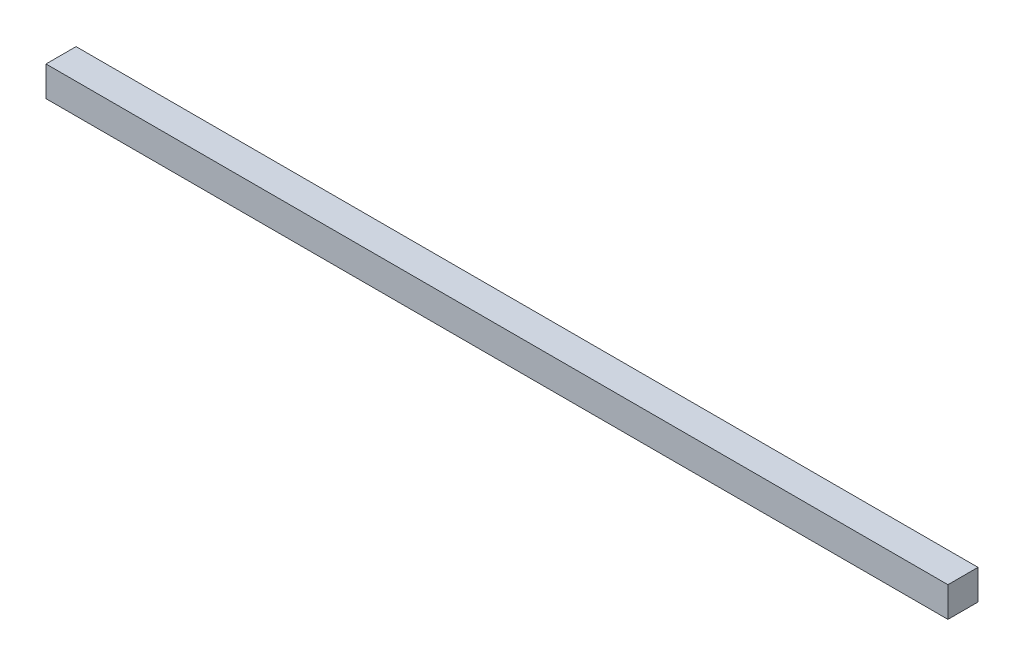
ISO-10303-21;
HEADER;
FILE_DESCRIPTION(('STEP AP214'),'2;1');
FILE_NAME('part.step','',(''),(''),'','','');
FILE_SCHEMA(('AUTOMOTIVE_DESIGN { 1 0 10303 214 1 1 1 1 }'));
ENDSEC;
DATA;
#1=APPLICATION_CONTEXT('core data for automotive mechanical design processes');
#2=APPLICATION_PROTOCOL_DEFINITION('international standard','automotive_design',2000,#1);
#3=PRODUCT_CONTEXT('',#1,'mechanical');
#4=PRODUCT('Part','Part','',(#3));
#5=PRODUCT_RELATED_PRODUCT_CATEGORY('part','',(#4));
#6=PRODUCT_DEFINITION_FORMATION('','',#4);
#7=PRODUCT_DEFINITION_CONTEXT('part definition',#1,'design');
#8=PRODUCT_DEFINITION('design','',#6,#7);
#9=PRODUCT_DEFINITION_SHAPE('','',#8);
#10=(LENGTH_UNIT() NAMED_UNIT(*) SI_UNIT(.MILLI.,.METRE.));
#11=(NAMED_UNIT(*) PLANE_ANGLE_UNIT() SI_UNIT($,.RADIAN.));
#12=(NAMED_UNIT(*) SI_UNIT($,.STERADIAN.) SOLID_ANGLE_UNIT());
#13=UNCERTAINTY_MEASURE_WITH_UNIT(LENGTH_MEASURE(1.E-05),#10,'distance_accuracy_value','');
#14=(GEOMETRIC_REPRESENTATION_CONTEXT(3) GLOBAL_UNCERTAINTY_ASSIGNED_CONTEXT((#13)) GLOBAL_UNIT_ASSIGNED_CONTEXT((#10,
#11,#12)) REPRESENTATION_CONTEXT('',''));
#15=CARTESIAN_POINT('',(0.,0.,0.));
#16=DIRECTION('',(0.,0.,1.));
#17=DIRECTION('',(1.,0.,0.));
#18=AXIS2_PLACEMENT_3D('',#15,#16,#17);
#19=CARTESIAN_POINT('',(-300.,20.,10.));
#20=DIRECTION('',(1.,0.,0.));
#21=DIRECTION('',(0.,0.,-1.));
#22=AXIS2_PLACEMENT_3D('',#19,#20,#21);
#23=PLANE('',#22);
#24=DIRECTION('',(0.,0.,1.));
#25=VECTOR('',#24,1.);
#26=CARTESIAN_POINT('',(-300.,0.,10.));
#27=LINE('',#26,#25);
#28=CARTESIAN_POINT('',(-300.,0.,-9.99999999999994));
#29=VERTEX_POINT('',#28);
#30=CARTESIAN_POINT('',(-300.,0.,10.));
#31=VERTEX_POINT('',#30);
#32=EDGE_CURVE('E96',#29,#31,#27,.T.);
#33=ORIENTED_EDGE('',*,*,#32,.T.);
#34=DIRECTION('',(0.,-1.,0.));
#35=VECTOR('',#34,1.);
#36=CARTESIAN_POINT('',(-300.,20.,10.));
#37=LINE('',#36,#35);
#38=CARTESIAN_POINT('',(-300.,20.,10.));
#39=VERTEX_POINT('',#38);
#40=EDGE_CURVE('E11',#39,#31,#37,.T.);
#41=ORIENTED_EDGE('',*,*,#40,.F.);
#42=DIRECTION('',(0.,0.,1.));
#43=VECTOR('',#42,1.);
#44=CARTESIAN_POINT('',(-300.,20.,10.));
#45=LINE('',#44,#43);
#46=CARTESIAN_POINT('',(-300.,20.,-9.99999999999994));
#47=VERTEX_POINT('',#46);
#48=EDGE_CURVE('E84',#47,#39,#45,.T.);
#49=ORIENTED_EDGE('',*,*,#48,.F.);
#50=DIRECTION('',(0.,-1.,0.));
#51=VECTOR('',#50,1.);
#52=CARTESIAN_POINT('',(-300.,20.,-9.99999999999994));
#53=LINE('',#52,#51);
#54=EDGE_CURVE('E92',#47,#29,#53,.T.);
#55=ORIENTED_EDGE('',*,*,#54,.T.);
#56=EDGE_LOOP('',(#33,#41,#49,#55));
#57=FACE_BOUND('',#56,.T.);
#58=ADVANCED_FACE('F33',(#57),#23,.F.);
#59=CARTESIAN_POINT('',(300.,20.,9.99999999999997));
#60=DIRECTION('',(0.,0.,-1.));
#61=DIRECTION('',(-1.,0.,0.));
#62=AXIS2_PLACEMENT_3D('',#59,#60,#61);
#63=PLANE('',#62);
#64=DIRECTION('',(1.,0.,0.));
#65=VECTOR('',#64,1.);
#66=CARTESIAN_POINT('',(300.,0.,9.99999999999997));
#67=LINE('',#66,#65);
#68=CARTESIAN_POINT('',(300.,0.,9.99999999999997));
#69=VERTEX_POINT('',#68);
#70=EDGE_CURVE('E88',#31,#69,#67,.T.);
#71=ORIENTED_EDGE('',*,*,#70,.T.);
#72=DIRECTION('',(0.,-1.,0.));
#73=VECTOR('',#72,1.);
#74=CARTESIAN_POINT('',(300.,20.,9.99999999999997));
#75=LINE('',#74,#73);
#76=CARTESIAN_POINT('',(300.,20.,9.99999999999997));
#77=VERTEX_POINT('',#76);
#78=EDGE_CURVE('E41',#77,#69,#75,.T.);
#79=ORIENTED_EDGE('',*,*,#78,.F.);
#80=DIRECTION('',(1.,0.,0.));
#81=VECTOR('',#80,1.);
#82=CARTESIAN_POINT('',(300.,20.,9.99999999999997));
#83=LINE('',#82,#81);
#84=EDGE_CURVE('E79',#39,#77,#83,.T.);
#85=ORIENTED_EDGE('',*,*,#84,.F.);
#86=ORIENTED_EDGE('',*,*,#40,.T.);
#87=EDGE_LOOP('',(#71,#79,#85,#86));
#88=FACE_BOUND('',#87,.T.);
#89=ADVANCED_FACE('F87',(#88),#63,.F.);
#90=CARTESIAN_POINT('',(300.,20.,9.99999999999997));
#91=DIRECTION('',(-1.,0.,0.));
#92=DIRECTION('',(0.,0.,1.));
#93=AXIS2_PLACEMENT_3D('',#90,#91,#92);
#94=PLANE('',#93);
#95=DIRECTION('',(0.,0.,-1.));
#96=VECTOR('',#95,1.);
#97=CARTESIAN_POINT('',(300.,0.,9.99999999999997));
#98=LINE('',#97,#96);
#99=CARTESIAN_POINT('',(300.,0.,-10.));
#100=VERTEX_POINT('',#99);
#101=EDGE_CURVE('E66',#69,#100,#98,.T.);
#102=ORIENTED_EDGE('',*,*,#101,.T.);
#103=DIRECTION('',(0.,-1.,0.));
#104=VECTOR('',#103,1.);
#105=CARTESIAN_POINT('',(300.,20.,-10.));
#106=LINE('',#105,#104);
#107=CARTESIAN_POINT('',(300.,20.,-10.));
#108=VERTEX_POINT('',#107);
#109=EDGE_CURVE('E89',#108,#100,#106,.T.);
#110=ORIENTED_EDGE('',*,*,#109,.F.);
#111=DIRECTION('',(0.,0.,-1.));
#112=VECTOR('',#111,1.);
#113=CARTESIAN_POINT('',(300.,20.,9.99999999999997));
#114=LINE('',#113,#112);
#115=EDGE_CURVE('E82',#77,#108,#114,.T.);
#116=ORIENTED_EDGE('',*,*,#115,.F.);
#117=ORIENTED_EDGE('',*,*,#78,.T.);
#118=EDGE_LOOP('',(#102,#110,#116,#117));
#119=FACE_BOUND('',#118,.T.);
#120=ADVANCED_FACE('F90',(#119),#94,.F.);
#121=CARTESIAN_POINT('',(300.,20.,-10.));
#122=DIRECTION('',(0.,0.,1.));
#123=DIRECTION('',(1.,0.,0.));
#124=AXIS2_PLACEMENT_3D('',#121,#122,#123);
#125=PLANE('',#124);
#126=DIRECTION('',(-1.,0.,0.));
#127=VECTOR('',#126,1.);
#128=CARTESIAN_POINT('',(300.,0.,-10.));
#129=LINE('',#128,#127);
#130=EDGE_CURVE('E72',#100,#29,#129,.T.);
#131=ORIENTED_EDGE('',*,*,#130,.T.);
#132=ORIENTED_EDGE('',*,*,#54,.F.);
#133=DIRECTION('',(-1.,0.,0.));
#134=VECTOR('',#133,1.);
#135=CARTESIAN_POINT('',(300.,20.,-10.));
#136=LINE('',#135,#134);
#137=EDGE_CURVE('E49',#108,#47,#136,.T.);
#138=ORIENTED_EDGE('',*,*,#137,.F.);
#139=ORIENTED_EDGE('',*,*,#109,.T.);
#140=EDGE_LOOP('',(#131,#132,#138,#139));
#141=FACE_BOUND('',#140,.T.);
#142=ADVANCED_FACE('F103',(#141),#125,.F.);
#143=CARTESIAN_POINT('',(0.,20.,0.));
#144=DIRECTION('',(0.,1.,0.));
#145=DIRECTION('',(0.,0.,1.));
#146=AXIS2_PLACEMENT_3D('',#143,#144,#145);
#147=PLANE('',#146);
#148=ORIENTED_EDGE('',*,*,#48,.T.);
#149=ORIENTED_EDGE('',*,*,#84,.T.);
#150=ORIENTED_EDGE('',*,*,#115,.T.);
#151=ORIENTED_EDGE('',*,*,#137,.T.);
#152=EDGE_LOOP('',(#148,#149,#150,#151));
#153=FACE_BOUND('',#152,.T.);
#154=ADVANCED_FACE('F80',(#153),#147,.T.);
#155=CARTESIAN_POINT('',(0.,0.,0.));
#156=DIRECTION('',(0.,1.,0.));
#157=DIRECTION('',(0.,0.,1.));
#158=AXIS2_PLACEMENT_3D('',#155,#156,#157);
#159=PLANE('',#158);
#160=ORIENTED_EDGE('',*,*,#32,.F.);
#161=ORIENTED_EDGE('',*,*,#130,.F.);
#162=ORIENTED_EDGE('',*,*,#101,.F.);
#163=ORIENTED_EDGE('',*,*,#70,.F.);
#164=EDGE_LOOP('',(#160,#161,#162,#163));
#165=FACE_BOUND('',#164,.T.);
#166=ADVANCED_FACE('F106',(#165),#159,.F.);
#167=CLOSED_SHELL('',(#58,#89,#120,#142,#154,#166));
#168=MANIFOLD_SOLID_BREP('B2',#167);
#169=ADVANCED_BREP_SHAPE_REPRESENTATION('',(#18,#168),#14);
#170=SHAPE_DEFINITION_REPRESENTATION(#9,#169);
ENDSEC;
END-ISO-10303-21;
